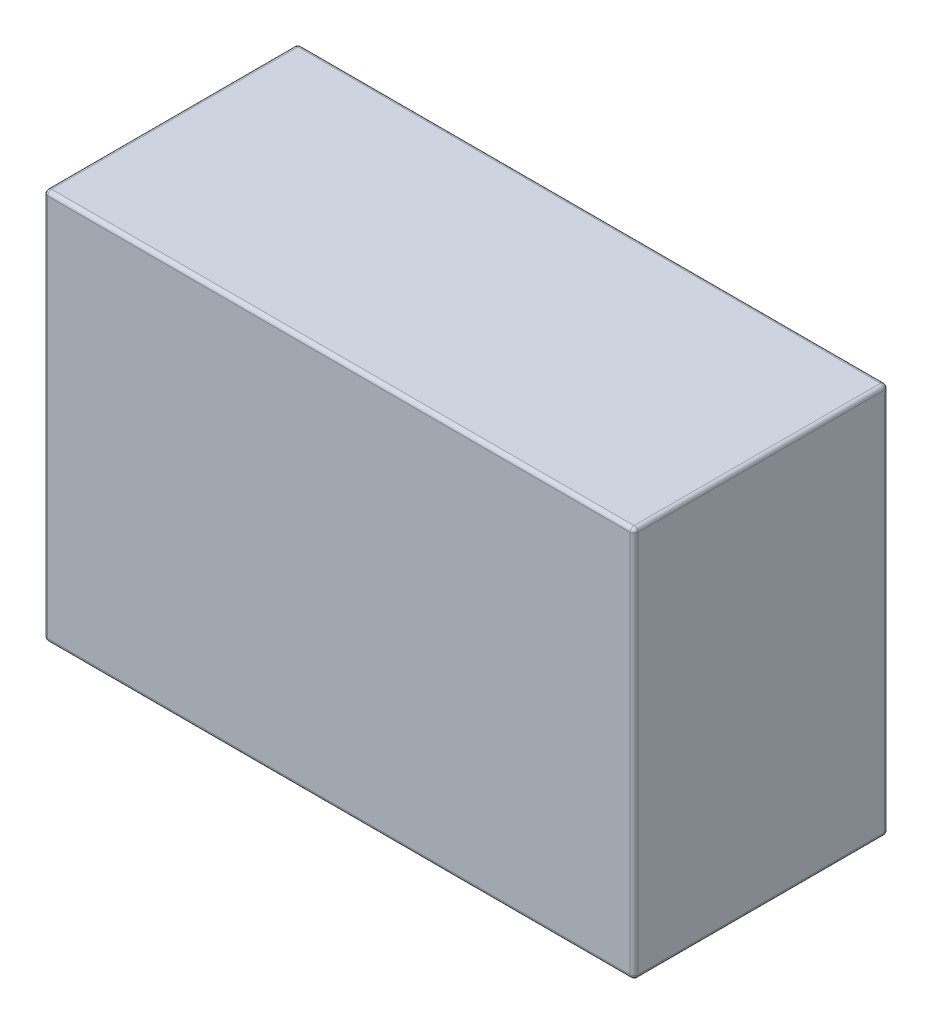
ISO-10303-21;
HEADER;
FILE_DESCRIPTION(('STEP AP214'),'2;1');
FILE_NAME('part.step','',(''),(''),'','','');
FILE_SCHEMA(('AUTOMOTIVE_DESIGN { 1 0 10303 214 1 1 1 1 }'));
ENDSEC;
DATA;
#1=APPLICATION_CONTEXT('core data for automotive mechanical design processes');
#2=APPLICATION_PROTOCOL_DEFINITION('international standard','automotive_design',2000,#1);
#3=PRODUCT_CONTEXT('',#1,'mechanical');
#4=PRODUCT('Part','Part','',(#3));
#5=PRODUCT_RELATED_PRODUCT_CATEGORY('part','',(#4));
#6=PRODUCT_DEFINITION_FORMATION('','',#4);
#7=PRODUCT_DEFINITION_CONTEXT('part definition',#1,'design');
#8=PRODUCT_DEFINITION('design','',#6,#7);
#9=PRODUCT_DEFINITION_SHAPE('','',#8);
#10=(LENGTH_UNIT() NAMED_UNIT(*) SI_UNIT(.MILLI.,.METRE.));
#11=(NAMED_UNIT(*) PLANE_ANGLE_UNIT() SI_UNIT($,.RADIAN.));
#12=(NAMED_UNIT(*) SI_UNIT($,.STERADIAN.) SOLID_ANGLE_UNIT());
#13=UNCERTAINTY_MEASURE_WITH_UNIT(LENGTH_MEASURE(1.E-05),#10,'distance_accuracy_value','');
#14=(GEOMETRIC_REPRESENTATION_CONTEXT(3) GLOBAL_UNCERTAINTY_ASSIGNED_CONTEXT((#13)) GLOBAL_UNIT_ASSIGNED_CONTEXT((#10,
#11,#12)) REPRESENTATION_CONTEXT('',''));
#15=CARTESIAN_POINT('',(0.,0.,0.));
#16=DIRECTION('',(0.,0.,1.));
#17=DIRECTION('',(1.,0.,0.));
#18=AXIS2_PLACEMENT_3D('',#15,#16,#17);
#19=CARTESIAN_POINT('',(75.5,100.,32.5));
#20=DIRECTION('',(-1.,0.,0.));
#21=DIRECTION('',(0.,0.,1.));
#22=AXIS2_PLACEMENT_3D('',#19,#20,#21);
#23=PLANE('',#22);
#24=DIRECTION('',(0.,0.,-1.));
#25=VECTOR('',#24,1.);
#26=CARTESIAN_POINT('',(75.5,1.,-32.5));
#27=LINE('',#26,#25);
#28=CARTESIAN_POINT('',(75.5,1.,31.5));
#29=VERTEX_POINT('',#28);
#30=CARTESIAN_POINT('',(75.5,1.,-31.5));
#31=VERTEX_POINT('',#30);
#32=EDGE_CURVE('E194',#29,#31,#27,.T.);
#33=ORIENTED_EDGE('',*,*,#32,.T.);
#34=DIRECTION('',(0.,-1.,0.));
#35=VECTOR('',#34,1.);
#36=CARTESIAN_POINT('',(75.5,100.,-31.5));
#37=LINE('',#36,#35);
#38=CARTESIAN_POINT('',(75.5,99.,-31.5));
#39=VERTEX_POINT('',#38);
#40=EDGE_CURVE('E197',#31,#39,#37,.F.);
#41=ORIENTED_EDGE('',*,*,#40,.T.);
#42=DIRECTION('',(0.,0.,-1.));
#43=VECTOR('',#42,1.);
#44=CARTESIAN_POINT('',(75.5,99.,32.5));
#45=LINE('',#44,#43);
#46=CARTESIAN_POINT('',(75.5,99.,31.5));
#47=VERTEX_POINT('',#46);
#48=EDGE_CURVE('E191',#39,#47,#45,.F.);
#49=ORIENTED_EDGE('',*,*,#48,.T.);
#50=DIRECTION('',(0.,-1.,0.));
#51=VECTOR('',#50,1.);
#52=CARTESIAN_POINT('',(75.5,100.,31.5));
#53=LINE('',#52,#51);
#54=EDGE_CURVE('E188',#47,#29,#53,.T.);
#55=ORIENTED_EDGE('',*,*,#54,.T.);
#56=EDGE_LOOP('',(#33,#41,#49,#55));
#57=FACE_BOUND('',#56,.T.);
#58=ADVANCED_FACE('F43',(#57),#23,.F.);
#59=CARTESIAN_POINT('',(-75.5,100.,-32.5));
#60=DIRECTION('',(0.,0.,1.));
#61=DIRECTION('',(1.,0.,0.));
#62=AXIS2_PLACEMENT_3D('',#59,#60,#61);
#63=PLANE('',#62);
#64=DIRECTION('',(0.,-1.,0.));
#65=VECTOR('',#64,1.);
#66=CARTESIAN_POINT('',(74.5,100.,-32.5));
#67=LINE('',#66,#65);
#68=CARTESIAN_POINT('',(74.5,99.,-32.5));
#69=VERTEX_POINT('',#68);
#70=CARTESIAN_POINT('',(74.5,1.,-32.5));
#71=VERTEX_POINT('',#70);
#72=EDGE_CURVE('E169',#69,#71,#67,.T.);
#73=ORIENTED_EDGE('',*,*,#72,.T.);
#74=DIRECTION('',(-1.,0.,0.));
#75=VECTOR('',#74,1.);
#76=CARTESIAN_POINT('',(-75.5,1.,-32.5));
#77=LINE('',#76,#75);
#78=CARTESIAN_POINT('',(-74.5,1.,-32.5));
#79=VERTEX_POINT('',#78);
#80=EDGE_CURVE('E138',#71,#79,#77,.T.);
#81=ORIENTED_EDGE('',*,*,#80,.T.);
#82=DIRECTION('',(0.,-1.,0.));
#83=VECTOR('',#82,1.);
#84=CARTESIAN_POINT('',(-74.5,100.,-32.5));
#85=LINE('',#84,#83);
#86=CARTESIAN_POINT('',(-74.5,99.,-32.5));
#87=VERTEX_POINT('',#86);
#88=EDGE_CURVE('E158',#79,#87,#85,.F.);
#89=ORIENTED_EDGE('',*,*,#88,.T.);
#90=DIRECTION('',(-1.,0.,0.));
#91=VECTOR('',#90,1.);
#92=CARTESIAN_POINT('',(-75.5,99.,-32.5));
#93=LINE('',#92,#91);
#94=EDGE_CURVE('E165',#87,#69,#93,.F.);
#95=ORIENTED_EDGE('',*,*,#94,.T.);
#96=EDGE_LOOP('',(#73,#81,#89,#95));
#97=FACE_BOUND('',#96,.T.);
#98=ADVANCED_FACE('F167',(#97),#63,.F.);
#99=CARTESIAN_POINT('',(-75.5,100.,32.5));
#100=DIRECTION('',(1.,0.,0.));
#101=DIRECTION('',(0.,0.,-1.));
#102=AXIS2_PLACEMENT_3D('',#99,#100,#101);
#103=PLANE('',#102);
#104=DIRECTION('',(0.,0.,1.));
#105=VECTOR('',#104,1.);
#106=CARTESIAN_POINT('',(-75.5,99.,32.5));
#107=LINE('',#106,#105);
#108=CARTESIAN_POINT('',(-75.5,99.,31.5));
#109=VERTEX_POINT('',#108);
#110=CARTESIAN_POINT('',(-75.5,99.,-31.5));
#111=VERTEX_POINT('',#110);
#112=EDGE_CURVE('E53',#109,#111,#107,.F.);
#113=ORIENTED_EDGE('',*,*,#112,.T.);
#114=DIRECTION('',(0.,-1.,0.));
#115=VECTOR('',#114,1.);
#116=CARTESIAN_POINT('',(-75.5,100.,-31.5));
#117=LINE('',#116,#115);
#118=CARTESIAN_POINT('',(-75.5,1.,-31.5));
#119=VERTEX_POINT('',#118);
#120=EDGE_CURVE('E11',#111,#119,#117,.T.);
#121=ORIENTED_EDGE('',*,*,#120,.T.);
#122=DIRECTION('',(0.,0.,1.));
#123=VECTOR('',#122,1.);
#124=CARTESIAN_POINT('',(-75.5,1.,32.5));
#125=LINE('',#124,#123);
#126=CARTESIAN_POINT('',(-75.5,1.,31.5));
#127=VERTEX_POINT('',#126);
#128=EDGE_CURVE('E227',#119,#127,#125,.T.);
#129=ORIENTED_EDGE('',*,*,#128,.T.);
#130=DIRECTION('',(0.,-1.,0.));
#131=VECTOR('',#130,1.);
#132=CARTESIAN_POINT('',(-75.5,100.,31.5));
#133=LINE('',#132,#131);
#134=EDGE_CURVE('E64',#127,#109,#133,.F.);
#135=ORIENTED_EDGE('',*,*,#134,.T.);
#136=EDGE_LOOP('',(#113,#121,#129,#135));
#137=FACE_BOUND('',#136,.T.);
#138=ADVANCED_FACE('F392',(#137),#103,.F.);
#139=CARTESIAN_POINT('',(-75.5,100.,32.5));
#140=DIRECTION('',(0.,0.,-1.));
#141=DIRECTION('',(-1.,0.,0.));
#142=AXIS2_PLACEMENT_3D('',#139,#140,#141);
#143=PLANE('',#142);
#144=DIRECTION('',(0.,-1.,0.));
#145=VECTOR('',#144,1.);
#146=CARTESIAN_POINT('',(74.5,100.,32.5));
#147=LINE('',#146,#145);
#148=CARTESIAN_POINT('',(74.5,1.,32.5));
#149=VERTEX_POINT('',#148);
#150=CARTESIAN_POINT('',(74.5,99.,32.5));
#151=VERTEX_POINT('',#150);
#152=EDGE_CURVE('E220',#149,#151,#147,.F.);
#153=ORIENTED_EDGE('',*,*,#152,.T.);
#154=DIRECTION('',(1.,0.,0.));
#155=VECTOR('',#154,1.);
#156=CARTESIAN_POINT('',(-75.5,99.,32.5));
#157=LINE('',#156,#155);
#158=CARTESIAN_POINT('',(-74.5,99.,32.5));
#159=VERTEX_POINT('',#158);
#160=EDGE_CURVE('E223',#151,#159,#157,.F.);
#161=ORIENTED_EDGE('',*,*,#160,.T.);
#162=DIRECTION('',(0.,-1.,0.));
#163=VECTOR('',#162,1.);
#164=CARTESIAN_POINT('',(-74.5,100.,32.5));
#165=LINE('',#164,#163);
#166=CARTESIAN_POINT('',(-74.5,1.,32.5));
#167=VERTEX_POINT('',#166);
#168=EDGE_CURVE('E214',#159,#167,#165,.T.);
#169=ORIENTED_EDGE('',*,*,#168,.T.);
#170=DIRECTION('',(1.,0.,0.));
#171=VECTOR('',#170,1.);
#172=CARTESIAN_POINT('',(75.5,1.,32.5));
#173=LINE('',#172,#171);
#174=EDGE_CURVE('E217',#167,#149,#173,.T.);
#175=ORIENTED_EDGE('',*,*,#174,.T.);
#176=EDGE_LOOP('',(#153,#161,#169,#175));
#177=FACE_BOUND('',#176,.T.);
#178=ADVANCED_FACE('F348',(#177),#143,.F.);
#179=CARTESIAN_POINT('',(0.,100.,0.));
#180=DIRECTION('',(0.,-1.,0.));
#181=DIRECTION('',(0.,0.,-1.));
#182=AXIS2_PLACEMENT_3D('',#179,#180,#181);
#183=PLANE('',#182);
#184=DIRECTION('',(0.,0.,-1.));
#185=VECTOR('',#184,1.);
#186=CARTESIAN_POINT('',(74.5,100.,0.));
#187=LINE('',#186,#185);
#188=CARTESIAN_POINT('',(74.5,100.,31.5));
#189=VERTEX_POINT('',#188);
#190=CARTESIAN_POINT('',(74.5,100.,-31.5));
#191=VERTEX_POINT('',#190);
#192=EDGE_CURVE('E207',#189,#191,#187,.T.);
#193=ORIENTED_EDGE('',*,*,#192,.T.);
#194=DIRECTION('',(-1.,0.,0.));
#195=VECTOR('',#194,1.);
#196=CARTESIAN_POINT('',(0.,100.,-31.5));
#197=LINE('',#196,#195);
#198=CARTESIAN_POINT('',(-74.5,100.,-31.5));
#199=VERTEX_POINT('',#198);
#200=EDGE_CURVE('E210',#191,#199,#197,.T.);
#201=ORIENTED_EDGE('',*,*,#200,.T.);
#202=DIRECTION('',(0.,0.,1.));
#203=VECTOR('',#202,1.);
#204=CARTESIAN_POINT('',(-74.5,100.,0.));
#205=LINE('',#204,#203);
#206=CARTESIAN_POINT('',(-74.5,100.,31.5));
#207=VERTEX_POINT('',#206);
#208=EDGE_CURVE('E201',#199,#207,#205,.T.);
#209=ORIENTED_EDGE('',*,*,#208,.T.);
#210=DIRECTION('',(1.,0.,0.));
#211=VECTOR('',#210,1.);
#212=CARTESIAN_POINT('',(0.,100.,31.5));
#213=LINE('',#212,#211);
#214=EDGE_CURVE('E204',#207,#189,#213,.T.);
#215=ORIENTED_EDGE('',*,*,#214,.T.);
#216=EDGE_LOOP('',(#193,#201,#209,#215));
#217=FACE_BOUND('',#216,.T.);
#218=ADVANCED_FACE('F337',(#217),#183,.F.);
#219=CARTESIAN_POINT('',(0.,0.,0.));
#220=DIRECTION('',(0.,-1.,0.));
#221=DIRECTION('',(0.,0.,-1.));
#222=AXIS2_PLACEMENT_3D('',#219,#220,#221);
#223=PLANE('',#222);
#224=DIRECTION('',(0.,0.,1.));
#225=VECTOR('',#224,1.);
#226=CARTESIAN_POINT('',(-74.5,0.,-32.5));
#227=LINE('',#226,#225);
#228=CARTESIAN_POINT('',(-74.5,0.,31.5));
#229=VERTEX_POINT('',#228);
#230=CARTESIAN_POINT('',(-74.5,0.,-31.5));
#231=VERTEX_POINT('',#230);
#232=EDGE_CURVE('E172',#229,#231,#227,.F.);
#233=ORIENTED_EDGE('',*,*,#232,.T.);
#234=DIRECTION('',(-1.,0.,0.));
#235=VECTOR('',#234,1.);
#236=CARTESIAN_POINT('',(75.5,0.,-31.5));
#237=LINE('',#236,#235);
#238=CARTESIAN_POINT('',(74.5,0.,-31.5));
#239=VERTEX_POINT('',#238);
#240=EDGE_CURVE('E140',#231,#239,#237,.F.);
#241=ORIENTED_EDGE('',*,*,#240,.T.);
#242=DIRECTION('',(0.,0.,-1.));
#243=VECTOR('',#242,1.);
#244=CARTESIAN_POINT('',(74.5,0.,32.5));
#245=LINE('',#244,#243);
#246=CARTESIAN_POINT('',(74.5,0.,31.5));
#247=VERTEX_POINT('',#246);
#248=EDGE_CURVE('E183',#239,#247,#245,.F.);
#249=ORIENTED_EDGE('',*,*,#248,.T.);
#250=DIRECTION('',(1.,0.,0.));
#251=VECTOR('',#250,1.);
#252=CARTESIAN_POINT('',(-75.5,0.,31.5));
#253=LINE('',#252,#251);
#254=EDGE_CURVE('E176',#247,#229,#253,.F.);
#255=ORIENTED_EDGE('',*,*,#254,.T.);
#256=EDGE_LOOP('',(#233,#241,#249,#255));
#257=FACE_BOUND('',#256,.T.);
#258=ADVANCED_FACE('F364',(#257),#223,.T.);
#259=CARTESIAN_POINT('',(0.,99.,31.5));
#260=DIRECTION('',(1.,0.,0.));
#261=DIRECTION('',(0.,0.,-1.));
#262=AXIS2_PLACEMENT_3D('',#259,#260,#261);
#263=CYLINDRICAL_SURFACE('',#262,1.);
#264=CARTESIAN_POINT('',(74.5,99.,31.5));
#265=DIRECTION('',(1.,0.,0.));
#266=DIRECTION('',(0.,0.,-1.));
#267=AXIS2_PLACEMENT_3D('',#264,#265,#266);
#268=CIRCLE('',#267,1.);
#269=EDGE_CURVE('E47',#189,#151,#268,.T.);
#270=ORIENTED_EDGE('',*,*,#269,.F.);
#271=ORIENTED_EDGE('',*,*,#214,.F.);
#272=CARTESIAN_POINT('',(-74.5,99.,31.5));
#273=DIRECTION('',(-1.,0.,0.));
#274=DIRECTION('',(0.,0.,1.));
#275=AXIS2_PLACEMENT_3D('',#272,#273,#274);
#276=CIRCLE('',#275,1.);
#277=EDGE_CURVE('E303',#159,#207,#276,.T.);
#278=ORIENTED_EDGE('',*,*,#277,.F.);
#279=ORIENTED_EDGE('',*,*,#160,.F.);
#280=EDGE_LOOP('',(#270,#271,#278,#279));
#281=FACE_BOUND('',#280,.T.);
#282=ADVANCED_FACE('F45',(#281),#263,.T.);
#283=CARTESIAN_POINT('',(74.5,99.,31.5));
#284=DIRECTION('',(0.,0.,1.));
#285=DIRECTION('',(1.,0.,0.));
#286=AXIS2_PLACEMENT_3D('',#283,#284,#285);
#287=SPHERICAL_SURFACE('',#286,1.);
#288=CARTESIAN_POINT('',(74.5,99.,31.5));
#289=DIRECTION('',(0.,0.,1.));
#290=DIRECTION('',(1.,0.,0.));
#291=AXIS2_PLACEMENT_3D('',#288,#289,#290);
#292=CIRCLE('',#291,1.);
#293=EDGE_CURVE('E296',#189,#47,#292,.F.);
#294=ORIENTED_EDGE('',*,*,#293,.F.);
#295=ORIENTED_EDGE('',*,*,#269,.T.);
#296=CARTESIAN_POINT('',(74.5,99.,31.5));
#297=DIRECTION('',(0.,1.,0.));
#298=DIRECTION('',(0.,0.,1.));
#299=AXIS2_PLACEMENT_3D('',#296,#297,#298);
#300=CIRCLE('',#299,1.);
#301=EDGE_CURVE('E300',#47,#151,#300,.F.);
#302=ORIENTED_EDGE('',*,*,#301,.F.);
#303=EDGE_LOOP('',(#294,#295,#302));
#304=FACE_BOUND('',#303,.T.);
#305=ADVANCED_FACE('F316',(#304),#287,.T.);
#306=CARTESIAN_POINT('',(-74.5,99.,31.5));
#307=DIRECTION('',(0.,1.,0.));
#308=DIRECTION('',(0.,0.,1.));
#309=AXIS2_PLACEMENT_3D('',#306,#307,#308);
#310=SPHERICAL_SURFACE('',#309,1.);
#311=CARTESIAN_POINT('',(-74.5,99.,31.5));
#312=DIRECTION('',(0.,1.,0.));
#313=DIRECTION('',(0.,0.,1.));
#314=AXIS2_PLACEMENT_3D('',#311,#312,#313);
#315=CIRCLE('',#314,1.);
#316=EDGE_CURVE('E289',#159,#109,#315,.F.);
#317=ORIENTED_EDGE('',*,*,#316,.F.);
#318=ORIENTED_EDGE('',*,*,#277,.T.);
#319=CARTESIAN_POINT('',(-74.5,99.,31.5));
#320=DIRECTION('',(0.,0.,1.));
#321=DIRECTION('',(1.,0.,0.));
#322=AXIS2_PLACEMENT_3D('',#319,#320,#321);
#323=CIRCLE('',#322,1.);
#324=EDGE_CURVE('E292',#109,#207,#323,.F.);
#325=ORIENTED_EDGE('',*,*,#324,.F.);
#326=EDGE_LOOP('',(#317,#318,#325));
#327=FACE_BOUND('',#326,.T.);
#328=ADVANCED_FACE('F548',(#327),#310,.T.);
#329=CARTESIAN_POINT('',(74.5,100.,31.5));
#330=DIRECTION('',(0.,-1.,0.));
#331=DIRECTION('',(0.,0.,-1.));
#332=AXIS2_PLACEMENT_3D('',#329,#330,#331);
#333=CYLINDRICAL_SURFACE('',#332,1.);
#334=ORIENTED_EDGE('',*,*,#301,.T.);
#335=ORIENTED_EDGE('',*,*,#152,.F.);
#336=CARTESIAN_POINT('',(74.5,1.,31.5));
#337=DIRECTION('',(0.,-1.,0.));
#338=DIRECTION('',(0.,0.,-1.));
#339=AXIS2_PLACEMENT_3D('',#336,#337,#338);
#340=CIRCLE('',#339,1.);
#341=EDGE_CURVE('E281',#29,#149,#340,.T.);
#342=ORIENTED_EDGE('',*,*,#341,.F.);
#343=ORIENTED_EDGE('',*,*,#54,.F.);
#344=EDGE_LOOP('',(#334,#335,#342,#343));
#345=FACE_BOUND('',#344,.T.);
#346=ADVANCED_FACE('F324',(#345),#333,.T.);
#347=CARTESIAN_POINT('',(74.5,99.,0.));
#348=DIRECTION('',(0.,0.,-1.));
#349=DIRECTION('',(-1.,0.,0.));
#350=AXIS2_PLACEMENT_3D('',#347,#348,#349);
#351=CYLINDRICAL_SURFACE('',#350,1.);
#352=ORIENTED_EDGE('',*,*,#293,.T.);
#353=ORIENTED_EDGE('',*,*,#48,.F.);
#354=CARTESIAN_POINT('',(74.5,99.,-31.5));
#355=DIRECTION('',(0.,0.,-1.));
#356=DIRECTION('',(-1.,0.,0.));
#357=AXIS2_PLACEMENT_3D('',#354,#355,#356);
#358=CIRCLE('',#357,1.);
#359=EDGE_CURVE('E277',#191,#39,#358,.T.);
#360=ORIENTED_EDGE('',*,*,#359,.F.);
#361=ORIENTED_EDGE('',*,*,#192,.F.);
#362=EDGE_LOOP('',(#352,#353,#360,#361));
#363=FACE_BOUND('',#362,.T.);
#364=ADVANCED_FACE('F334',(#363),#351,.T.);
#365=CARTESIAN_POINT('',(0.,99.,-31.5));
#366=DIRECTION('',(-1.,0.,0.));
#367=DIRECTION('',(0.,0.,1.));
#368=AXIS2_PLACEMENT_3D('',#365,#366,#367);
#369=CYLINDRICAL_SURFACE('',#368,1.);
#370=CARTESIAN_POINT('',(-74.5,99.,-31.5));
#371=DIRECTION('',(-1.,0.,0.));
#372=DIRECTION('',(0.,0.,1.));
#373=AXIS2_PLACEMENT_3D('',#370,#371,#372);
#374=CIRCLE('',#373,1.);
#375=EDGE_CURVE('E269',#199,#87,#374,.T.);
#376=ORIENTED_EDGE('',*,*,#375,.F.);
#377=ORIENTED_EDGE('',*,*,#200,.F.);
#378=CARTESIAN_POINT('',(74.5,99.,-31.5));
#379=DIRECTION('',(1.,0.,0.));
#380=DIRECTION('',(0.,0.,-1.));
#381=AXIS2_PLACEMENT_3D('',#378,#379,#380);
#382=CIRCLE('',#381,1.);
#383=EDGE_CURVE('E273',#69,#191,#382,.T.);
#384=ORIENTED_EDGE('',*,*,#383,.F.);
#385=ORIENTED_EDGE('',*,*,#94,.F.);
#386=EDGE_LOOP('',(#376,#377,#384,#385));
#387=FACE_BOUND('',#386,.T.);
#388=ADVANCED_FACE('F341',(#387),#369,.T.);
#389=CARTESIAN_POINT('',(-74.5,99.,0.));
#390=DIRECTION('',(0.,0.,1.));
#391=DIRECTION('',(1.,0.,0.));
#392=AXIS2_PLACEMENT_3D('',#389,#390,#391);
#393=CYLINDRICAL_SURFACE('',#392,1.);
#394=ORIENTED_EDGE('',*,*,#324,.T.);
#395=ORIENTED_EDGE('',*,*,#208,.F.);
#396=CARTESIAN_POINT('',(-74.5,99.,-31.5));
#397=DIRECTION('',(0.,0.,-1.));
#398=DIRECTION('',(-1.,0.,0.));
#399=AXIS2_PLACEMENT_3D('',#396,#397,#398);
#400=CIRCLE('',#399,1.);
#401=EDGE_CURVE('E266',#111,#199,#400,.T.);
#402=ORIENTED_EDGE('',*,*,#401,.F.);
#403=ORIENTED_EDGE('',*,*,#112,.F.);
#404=EDGE_LOOP('',(#394,#395,#402,#403));
#405=FACE_BOUND('',#404,.T.);
#406=ADVANCED_FACE('F346',(#405),#393,.T.);
#407=CARTESIAN_POINT('',(-74.5,100.,31.5));
#408=DIRECTION('',(0.,-1.,0.));
#409=DIRECTION('',(0.,0.,-1.));
#410=AXIS2_PLACEMENT_3D('',#407,#408,#409);
#411=CYLINDRICAL_SURFACE('',#410,1.);
#412=ORIENTED_EDGE('',*,*,#316,.T.);
#413=ORIENTED_EDGE('',*,*,#134,.F.);
#414=CARTESIAN_POINT('',(-74.5,1.,31.5));
#415=DIRECTION('',(0.,-1.,0.));
#416=DIRECTION('',(0.,0.,-1.));
#417=AXIS2_PLACEMENT_3D('',#414,#415,#416);
#418=CIRCLE('',#417,1.);
#419=EDGE_CURVE('E262',#167,#127,#418,.T.);
#420=ORIENTED_EDGE('',*,*,#419,.F.);
#421=ORIENTED_EDGE('',*,*,#168,.F.);
#422=EDGE_LOOP('',(#412,#413,#420,#421));
#423=FACE_BOUND('',#422,.T.);
#424=ADVANCED_FACE('F357',(#423),#411,.T.);
#425=CARTESIAN_POINT('',(-75.5,1.,31.5));
#426=DIRECTION('',(-1.,0.,0.));
#427=DIRECTION('',(0.,0.,1.));
#428=AXIS2_PLACEMENT_3D('',#425,#426,#427);
#429=CYLINDRICAL_SURFACE('',#428,1.);
#430=CARTESIAN_POINT('',(74.5,1.,31.5));
#431=DIRECTION('',(1.,0.,0.));
#432=DIRECTION('',(0.,0.,-1.));
#433=AXIS2_PLACEMENT_3D('',#430,#431,#432);
#434=CIRCLE('',#433,1.);
#435=EDGE_CURVE('E285',#149,#247,#434,.T.);
#436=ORIENTED_EDGE('',*,*,#435,.F.);
#437=ORIENTED_EDGE('',*,*,#174,.F.);
#438=CARTESIAN_POINT('',(-74.5,1.,31.5));
#439=DIRECTION('',(-1.,0.,0.));
#440=DIRECTION('',(0.,0.,1.));
#441=AXIS2_PLACEMENT_3D('',#438,#439,#440);
#442=CIRCLE('',#441,1.);
#443=EDGE_CURVE('E258',#229,#167,#442,.T.);
#444=ORIENTED_EDGE('',*,*,#443,.F.);
#445=ORIENTED_EDGE('',*,*,#254,.F.);
#446=EDGE_LOOP('',(#436,#437,#444,#445));
#447=FACE_BOUND('',#446,.T.);
#448=ADVANCED_FACE('F353',(#447),#429,.T.);
#449=CARTESIAN_POINT('',(74.5,1.,31.5));
#450=DIRECTION('',(0.,0.,1.));
#451=DIRECTION('',(0.,-1.,0.));
#452=AXIS2_PLACEMENT_3D('',#449,#450,#451);
#453=SPHERICAL_SURFACE('',#452,1.);
#454=ORIENTED_EDGE('',*,*,#341,.T.);
#455=ORIENTED_EDGE('',*,*,#435,.T.);
#456=CARTESIAN_POINT('',(74.5,1.,31.5));
#457=DIRECTION('',(0.,0.,1.));
#458=DIRECTION('',(1.,0.,0.));
#459=AXIS2_PLACEMENT_3D('',#456,#457,#458);
#460=CIRCLE('',#459,1.);
#461=EDGE_CURVE('E254',#29,#247,#460,.F.);
#462=ORIENTED_EDGE('',*,*,#461,.F.);
#463=EDGE_LOOP('',(#454,#455,#462));
#464=FACE_BOUND('',#463,.T.);
#465=ADVANCED_FACE('F367',(#464),#453,.T.);
#466=CARTESIAN_POINT('',(74.5,99.,-31.5));
#467=DIRECTION('',(0.,1.,0.));
#468=DIRECTION('',(0.,0.,1.));
#469=AXIS2_PLACEMENT_3D('',#466,#467,#468);
#470=SPHERICAL_SURFACE('',#469,1.);
#471=ORIENTED_EDGE('',*,*,#383,.T.);
#472=ORIENTED_EDGE('',*,*,#359,.T.);
#473=CARTESIAN_POINT('',(74.5,99.,-31.5));
#474=DIRECTION('',(0.,1.,0.));
#475=DIRECTION('',(0.,0.,1.));
#476=AXIS2_PLACEMENT_3D('',#473,#474,#475);
#477=CIRCLE('',#476,1.);
#478=EDGE_CURVE('E251',#69,#39,#477,.F.);
#479=ORIENTED_EDGE('',*,*,#478,.F.);
#480=EDGE_LOOP('',(#471,#472,#479));
#481=FACE_BOUND('',#480,.T.);
#482=ADVANCED_FACE('F377',(#481),#470,.T.);
#483=CARTESIAN_POINT('',(-74.5,99.,-31.5));
#484=DIRECTION('',(0.,1.,0.));
#485=DIRECTION('',(0.,0.,1.));
#486=AXIS2_PLACEMENT_3D('',#483,#484,#485);
#487=SPHERICAL_SURFACE('',#486,1.);
#488=ORIENTED_EDGE('',*,*,#401,.T.);
#489=ORIENTED_EDGE('',*,*,#375,.T.);
#490=CARTESIAN_POINT('',(-74.5,99.,-31.5));
#491=DIRECTION('',(0.,1.,0.));
#492=DIRECTION('',(0.,0.,1.));
#493=AXIS2_PLACEMENT_3D('',#490,#491,#492);
#494=CIRCLE('',#493,1.);
#495=EDGE_CURVE('E161',#111,#87,#494,.F.);
#496=ORIENTED_EDGE('',*,*,#495,.F.);
#497=EDGE_LOOP('',(#488,#489,#496));
#498=FACE_BOUND('',#497,.T.);
#499=ADVANCED_FACE('F379',(#498),#487,.T.);
#500=CARTESIAN_POINT('',(-74.5,1.,31.5));
#501=DIRECTION('',(0.,0.,1.));
#502=DIRECTION('',(0.,-1.,0.));
#503=AXIS2_PLACEMENT_3D('',#500,#501,#502);
#504=SPHERICAL_SURFACE('',#503,1.);
#505=ORIENTED_EDGE('',*,*,#443,.T.);
#506=ORIENTED_EDGE('',*,*,#419,.T.);
#507=CARTESIAN_POINT('',(-74.5,1.,31.5));
#508=DIRECTION('',(0.,0.,1.));
#509=DIRECTION('',(1.,0.,0.));
#510=AXIS2_PLACEMENT_3D('',#507,#508,#509);
#511=CIRCLE('',#510,1.);
#512=EDGE_CURVE('E245',#229,#127,#511,.F.);
#513=ORIENTED_EDGE('',*,*,#512,.F.);
#514=EDGE_LOOP('',(#505,#506,#513));
#515=FACE_BOUND('',#514,.T.);
#516=ADVANCED_FACE('F359',(#515),#504,.T.);
#517=CARTESIAN_POINT('',(74.5,1.,32.5));
#518=DIRECTION('',(0.,0.,1.));
#519=DIRECTION('',(1.,0.,0.));
#520=AXIS2_PLACEMENT_3D('',#517,#518,#519);
#521=CYLINDRICAL_SURFACE('',#520,1.);
#522=ORIENTED_EDGE('',*,*,#461,.T.);
#523=ORIENTED_EDGE('',*,*,#248,.F.);
#524=CARTESIAN_POINT('',(74.5,1.,-31.5));
#525=DIRECTION('',(0.,0.,-1.));
#526=DIRECTION('',(-1.,0.,0.));
#527=AXIS2_PLACEMENT_3D('',#524,#525,#526);
#528=CIRCLE('',#527,1.);
#529=EDGE_CURVE('E241',#31,#239,#528,.T.);
#530=ORIENTED_EDGE('',*,*,#529,.F.);
#531=ORIENTED_EDGE('',*,*,#32,.F.);
#532=EDGE_LOOP('',(#522,#523,#530,#531));
#533=FACE_BOUND('',#532,.T.);
#534=ADVANCED_FACE('F369',(#533),#521,.T.);
#535=CARTESIAN_POINT('',(74.5,100.,-31.5));
#536=DIRECTION('',(0.,-1.,0.));
#537=DIRECTION('',(0.,0.,-1.));
#538=AXIS2_PLACEMENT_3D('',#535,#536,#537);
#539=CYLINDRICAL_SURFACE('',#538,1.);
#540=ORIENTED_EDGE('',*,*,#478,.T.);
#541=ORIENTED_EDGE('',*,*,#40,.F.);
#542=CARTESIAN_POINT('',(74.5,1.,-31.5));
#543=DIRECTION('',(0.,-1.,0.));
#544=DIRECTION('',(0.,0.,-1.));
#545=AXIS2_PLACEMENT_3D('',#542,#543,#544);
#546=CIRCLE('',#545,1.);
#547=EDGE_CURVE('E155',#71,#31,#546,.T.);
#548=ORIENTED_EDGE('',*,*,#547,.F.);
#549=ORIENTED_EDGE('',*,*,#72,.F.);
#550=EDGE_LOOP('',(#540,#541,#548,#549));
#551=FACE_BOUND('',#550,.T.);
#552=ADVANCED_FACE('F375',(#551),#539,.T.);
#553=CARTESIAN_POINT('',(-74.5,100.,-31.5));
#554=DIRECTION('',(0.,-1.,0.));
#555=DIRECTION('',(0.,0.,-1.));
#556=AXIS2_PLACEMENT_3D('',#553,#554,#555);
#557=CYLINDRICAL_SURFACE('',#556,1.);
#558=ORIENTED_EDGE('',*,*,#495,.T.);
#559=ORIENTED_EDGE('',*,*,#88,.F.);
#560=CARTESIAN_POINT('',(-74.5,1.,-31.5));
#561=DIRECTION('',(0.,-1.,0.));
#562=DIRECTION('',(0.,0.,-1.));
#563=AXIS2_PLACEMENT_3D('',#560,#561,#562);
#564=CIRCLE('',#563,1.);
#565=EDGE_CURVE('E146',#119,#79,#564,.T.);
#566=ORIENTED_EDGE('',*,*,#565,.F.);
#567=ORIENTED_EDGE('',*,*,#120,.F.);
#568=EDGE_LOOP('',(#558,#559,#566,#567));
#569=FACE_BOUND('',#568,.T.);
#570=ADVANCED_FACE('F159',(#569),#557,.T.);
#571=CARTESIAN_POINT('',(-74.5,1.,32.5));
#572=DIRECTION('',(0.,0.,-1.));
#573=DIRECTION('',(-1.,0.,0.));
#574=AXIS2_PLACEMENT_3D('',#571,#572,#573);
#575=CYLINDRICAL_SURFACE('',#574,1.);
#576=ORIENTED_EDGE('',*,*,#512,.T.);
#577=ORIENTED_EDGE('',*,*,#128,.F.);
#578=CARTESIAN_POINT('',(-74.5,1.,-31.5));
#579=DIRECTION('',(0.,0.,-1.));
#580=DIRECTION('',(-1.,0.,0.));
#581=AXIS2_PLACEMENT_3D('',#578,#579,#580);
#582=CIRCLE('',#581,1.);
#583=EDGE_CURVE('E150',#231,#119,#582,.T.);
#584=ORIENTED_EDGE('',*,*,#583,.F.);
#585=ORIENTED_EDGE('',*,*,#232,.F.);
#586=EDGE_LOOP('',(#576,#577,#584,#585));
#587=FACE_BOUND('',#586,.T.);
#588=ADVANCED_FACE('F362',(#587),#575,.T.);
#589=CARTESIAN_POINT('',(74.5,1.,-31.5));
#590=DIRECTION('',(1.,0.,0.));
#591=DIRECTION('',(0.,1.,0.));
#592=AXIS2_PLACEMENT_3D('',#589,#590,#591);
#593=SPHERICAL_SURFACE('',#592,1.);
#594=ORIENTED_EDGE('',*,*,#547,.T.);
#595=ORIENTED_EDGE('',*,*,#529,.T.);
#596=CARTESIAN_POINT('',(74.5,1.,-31.5));
#597=DIRECTION('',(1.,0.,0.));
#598=DIRECTION('',(0.,0.,-1.));
#599=AXIS2_PLACEMENT_3D('',#596,#597,#598);
#600=CIRCLE('',#599,1.);
#601=EDGE_CURVE('E143',#71,#239,#600,.F.);
#602=ORIENTED_EDGE('',*,*,#601,.F.);
#603=EDGE_LOOP('',(#594,#595,#602));
#604=FACE_BOUND('',#603,.T.);
#605=ADVANCED_FACE('F373',(#604),#593,.T.);
#606=CARTESIAN_POINT('',(-74.5,1.,-31.5));
#607=DIRECTION('',(-1.,0.,0.));
#608=DIRECTION('',(0.,-1.,0.));
#609=AXIS2_PLACEMENT_3D('',#606,#607,#608);
#610=SPHERICAL_SURFACE('',#609,1.);
#611=ORIENTED_EDGE('',*,*,#583,.T.);
#612=ORIENTED_EDGE('',*,*,#565,.T.);
#613=CARTESIAN_POINT('',(-74.5,1.,-31.5));
#614=DIRECTION('',(-1.,0.,0.));
#615=DIRECTION('',(0.,0.,1.));
#616=AXIS2_PLACEMENT_3D('',#613,#614,#615);
#617=CIRCLE('',#616,1.);
#618=EDGE_CURVE('E134',#231,#79,#617,.F.);
#619=ORIENTED_EDGE('',*,*,#618,.F.);
#620=EDGE_LOOP('',(#611,#612,#619));
#621=FACE_BOUND('',#620,.T.);
#622=ADVANCED_FACE('F148',(#621),#610,.T.);
#623=CARTESIAN_POINT('',(-75.5,1.,-31.5));
#624=DIRECTION('',(1.,0.,0.));
#625=DIRECTION('',(0.,0.,-1.));
#626=AXIS2_PLACEMENT_3D('',#623,#624,#625);
#627=CYLINDRICAL_SURFACE('',#626,1.);
#628=ORIENTED_EDGE('',*,*,#601,.T.);
#629=ORIENTED_EDGE('',*,*,#240,.F.);
#630=ORIENTED_EDGE('',*,*,#618,.T.);
#631=ORIENTED_EDGE('',*,*,#80,.F.);
#632=EDGE_LOOP('',(#628,#629,#630,#631));
#633=FACE_BOUND('',#632,.T.);
#634=ADVANCED_FACE('F136',(#633),#627,.T.);
#635=CLOSED_SHELL('',(#58,#98,#138,#178,#218,#258,#282,#305,#328,#346,#364,#388,#406,#424,#448,
#465,#482,#499,#516,#534,#552,#570,#588,#605,#622,#634));
#636=MANIFOLD_SOLID_BREP('B2',#635);
#637=ADVANCED_BREP_SHAPE_REPRESENTATION('',(#18,#636),#14);
#638=SHAPE_DEFINITION_REPRESENTATION(#9,#637);
ENDSEC;
END-ISO-10303-21;
